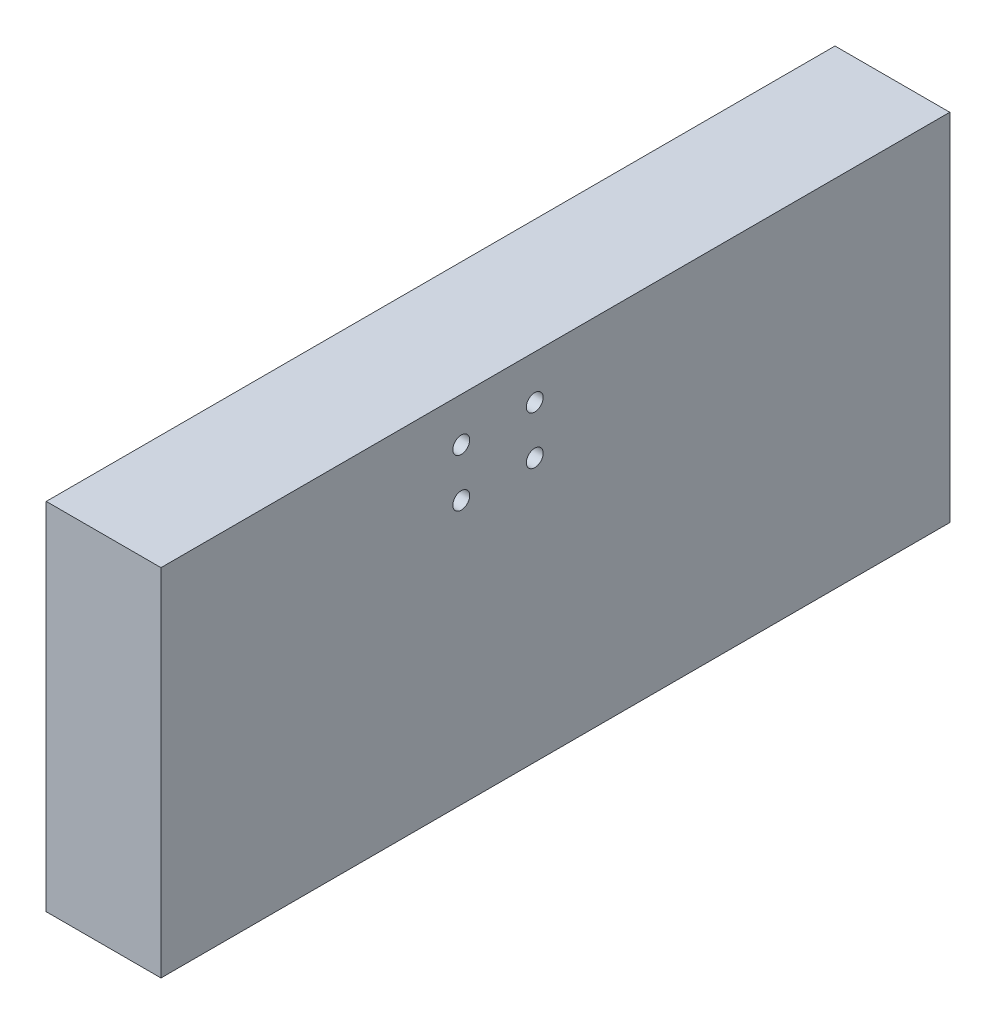
ISO-10303-21;
HEADER;
FILE_DESCRIPTION(('STEP AP214'),'2;1');
FILE_NAME('part.step','',(''),(''),'','','');
FILE_SCHEMA(('AUTOMOTIVE_DESIGN { 1 0 10303 214 1 1 1 1 }'));
ENDSEC;
DATA;
#1=APPLICATION_CONTEXT('core data for automotive mechanical design processes');
#2=APPLICATION_PROTOCOL_DEFINITION('international standard','automotive_design',2000,#1);
#3=PRODUCT_CONTEXT('',#1,'mechanical');
#4=PRODUCT('Part','Part','',(#3));
#5=PRODUCT_RELATED_PRODUCT_CATEGORY('part','',(#4));
#6=PRODUCT_DEFINITION_FORMATION('','',#4);
#7=PRODUCT_DEFINITION_CONTEXT('part definition',#1,'design');
#8=PRODUCT_DEFINITION('design','',#6,#7);
#9=PRODUCT_DEFINITION_SHAPE('','',#8);
#10=(LENGTH_UNIT() NAMED_UNIT(*) SI_UNIT(.MILLI.,.METRE.));
#11=(NAMED_UNIT(*) PLANE_ANGLE_UNIT() SI_UNIT($,.RADIAN.));
#12=(NAMED_UNIT(*) SI_UNIT($,.STERADIAN.) SOLID_ANGLE_UNIT());
#13=UNCERTAINTY_MEASURE_WITH_UNIT(LENGTH_MEASURE(1.E-05),#10,'distance_accuracy_value','');
#14=(GEOMETRIC_REPRESENTATION_CONTEXT(3) GLOBAL_UNCERTAINTY_ASSIGNED_CONTEXT((#13)) GLOBAL_UNIT_ASSIGNED_CONTEXT((#10,
#11,#12)) REPRESENTATION_CONTEXT('',''));
#15=CARTESIAN_POINT('',(0.,0.,0.));
#16=DIRECTION('',(0.,0.,1.));
#17=DIRECTION('',(1.,0.,0.));
#18=AXIS2_PLACEMENT_3D('',#15,#16,#17);
#19=CARTESIAN_POINT('',(-75.,-59.,-75.));
#20=DIRECTION('',(0.,0.,-1.));
#21=DIRECTION('',(-1.,0.,0.));
#22=AXIS2_PLACEMENT_3D('',#19,#20,#21);
#23=PLANE('',#22);
#24=DIRECTION('',(0.,1.,0.));
#25=VECTOR('',#24,1.);
#26=CARTESIAN_POINT('',(-55.95,-59.,-75.));
#27=LINE('',#26,#25);
#28=CARTESIAN_POINT('',(-55.95,-59.,-75.));
#29=VERTEX_POINT('',#28);
#30=CARTESIAN_POINT('',(-55.95,0.,-75.));
#31=VERTEX_POINT('',#30);
#32=EDGE_CURVE('E160',#29,#31,#27,.T.);
#33=ORIENTED_EDGE('',*,*,#32,.F.);
#34=DIRECTION('',(-1.,0.,0.));
#35=VECTOR('',#34,1.);
#36=CARTESIAN_POINT('',(-75.,-59.,-75.));
#37=LINE('',#36,#35);
#38=CARTESIAN_POINT('',(-75.,-59.,-75.));
#39=VERTEX_POINT('',#38);
#40=EDGE_CURVE('E59',#29,#39,#37,.T.);
#41=ORIENTED_EDGE('',*,*,#40,.T.);
#42=DIRECTION('',(0.,1.,0.));
#43=VECTOR('',#42,1.);
#44=CARTESIAN_POINT('',(-75.,-59.,-75.));
#45=LINE('',#44,#43);
#46=CARTESIAN_POINT('',(-75.,0.,-75.));
#47=VERTEX_POINT('',#46);
#48=EDGE_CURVE('E11',#39,#47,#45,.T.);
#49=ORIENTED_EDGE('',*,*,#48,.T.);
#50=DIRECTION('',(-1.,0.,0.));
#51=VECTOR('',#50,1.);
#52=CARTESIAN_POINT('',(-75.,0.,-75.));
#53=LINE('',#52,#51);
#54=EDGE_CURVE('E104',#31,#47,#53,.T.);
#55=ORIENTED_EDGE('',*,*,#54,.F.);
#56=EDGE_LOOP('',(#33,#41,#49,#55));
#57=FACE_BOUND('',#56,.T.);
#58=ADVANCED_FACE('F43',(#57),#23,.T.);
#59=CARTESIAN_POINT('',(-75.,-59.,75.));
#60=DIRECTION('',(-1.,0.,0.));
#61=DIRECTION('',(0.,0.,1.));
#62=AXIS2_PLACEMENT_3D('',#59,#60,#61);
#63=PLANE('',#62);
#64=DIRECTION('',(0.,1.,0.));
#65=VECTOR('',#64,1.);
#66=CARTESIAN_POINT('',(-75.,-59.,55.95));
#67=LINE('',#66,#65);
#68=CARTESIAN_POINT('',(-75.,-59.,55.95));
#69=VERTEX_POINT('',#68);
#70=CARTESIAN_POINT('',(-75.,0.,55.95));
#71=VERTEX_POINT('',#70);
#72=EDGE_CURVE('E88',#69,#71,#67,.T.);
#73=ORIENTED_EDGE('',*,*,#72,.T.);
#74=DIRECTION('',(0.,0.,1.));
#75=VECTOR('',#74,1.);
#76=CARTESIAN_POINT('',(-75.,0.,75.));
#77=LINE('',#76,#75);
#78=EDGE_CURVE('E117',#47,#71,#77,.T.);
#79=ORIENTED_EDGE('',*,*,#78,.F.);
#80=ORIENTED_EDGE('',*,*,#48,.F.);
#81=DIRECTION('',(0.,0.,1.));
#82=VECTOR('',#81,1.);
#83=CARTESIAN_POINT('',(-75.,-59.,75.));
#84=LINE('',#83,#82);
#85=EDGE_CURVE('E53',#39,#69,#84,.T.);
#86=ORIENTED_EDGE('',*,*,#85,.T.);
#87=EDGE_LOOP('',(#73,#79,#80,#86));
#88=FACE_BOUND('',#87,.T.);
#89=CARTESIAN_POINT('',(-75.,-7.24999999999999,6.1));
#90=DIRECTION('',(1.,0.,0.));
#91=DIRECTION('',(0.,0.,-1.));
#92=AXIS2_PLACEMENT_3D('',#89,#90,#91);
#93=CIRCLE('',#92,1.4);
#94=CARTESIAN_POINT('',(-75.,-7.24999999999999,4.7));
#95=VERTEX_POINT('',#94);
#96=EDGE_CURVE('E171',#95,#95,#93,.T.);
#97=ORIENTED_EDGE('',*,*,#96,.T.);
#98=EDGE_LOOP('',(#97));
#99=FACE_BOUND('',#98,.T.);
#100=CARTESIAN_POINT('',(-75.,-7.25,-6.1));
#101=DIRECTION('',(-1.,0.,0.));
#102=DIRECTION('',(0.,0.,1.));
#103=AXIS2_PLACEMENT_3D('',#100,#101,#102);
#104=CIRCLE('',#103,1.4);
#105=CARTESIAN_POINT('',(-75.,-7.25,-4.7));
#106=VERTEX_POINT('',#105);
#107=EDGE_CURVE('E112',#106,#106,#104,.T.);
#108=ORIENTED_EDGE('',*,*,#107,.F.);
#109=EDGE_LOOP('',(#108));
#110=FACE_BOUND('',#109,.T.);
#111=CARTESIAN_POINT('',(-75.,-15.25,6.1));
#112=DIRECTION('',(-1.,0.,0.));
#113=DIRECTION('',(0.,0.,1.));
#114=AXIS2_PLACEMENT_3D('',#111,#112,#113);
#115=CIRCLE('',#114,1.4);
#116=CARTESIAN_POINT('',(-75.,-15.25,7.5));
#117=VERTEX_POINT('',#116);
#118=EDGE_CURVE('E167',#117,#117,#115,.T.);
#119=ORIENTED_EDGE('',*,*,#118,.F.);
#120=EDGE_LOOP('',(#119));
#121=FACE_BOUND('',#120,.T.);
#122=CARTESIAN_POINT('',(-75.,-15.25,-6.1));
#123=DIRECTION('',(1.,0.,0.));
#124=DIRECTION('',(0.,0.,-1.));
#125=AXIS2_PLACEMENT_3D('',#122,#123,#124);
#126=CIRCLE('',#125,1.4);
#127=CARTESIAN_POINT('',(-75.,-15.25,-7.5));
#128=VERTEX_POINT('',#127);
#129=EDGE_CURVE('E162',#128,#128,#126,.T.);
#130=ORIENTED_EDGE('',*,*,#129,.T.);
#131=EDGE_LOOP('',(#130));
#132=FACE_BOUND('',#131,.T.);
#133=ADVANCED_FACE('F144',(#88,#99,#110,#121,#132),#63,.T.);
#134=CARTESIAN_POINT('',(-55.95,-59.,55.95));
#135=DIRECTION('',(-1.,0.,0.));
#136=DIRECTION('',(0.,0.,1.));
#137=AXIS2_PLACEMENT_3D('',#134,#135,#136);
#138=PLANE('',#137);
#139=CARTESIAN_POINT('',(-55.95,-15.25,6.1));
#140=DIRECTION('',(-1.,0.,0.));
#141=DIRECTION('',(0.,0.,1.));
#142=AXIS2_PLACEMENT_3D('',#139,#140,#141);
#143=CIRCLE('',#142,1.4);
#144=CARTESIAN_POINT('',(-55.95,-15.25,7.5));
#145=VERTEX_POINT('',#144);
#146=EDGE_CURVE('E132',#145,#145,#143,.T.);
#147=ORIENTED_EDGE('',*,*,#146,.T.);
#148=EDGE_LOOP('',(#147));
#149=FACE_BOUND('',#148,.T.);
#150=CARTESIAN_POINT('',(-55.95,-7.25,-6.1));
#151=DIRECTION('',(-1.,0.,0.));
#152=DIRECTION('',(0.,0.,1.));
#153=AXIS2_PLACEMENT_3D('',#150,#151,#152);
#154=CIRCLE('',#153,1.4);
#155=CARTESIAN_POINT('',(-55.95,-7.25,-4.7));
#156=VERTEX_POINT('',#155);
#157=EDGE_CURVE('E125',#156,#156,#154,.T.);
#158=ORIENTED_EDGE('',*,*,#157,.T.);
#159=EDGE_LOOP('',(#158));
#160=FACE_BOUND('',#159,.T.);
#161=DIRECTION('',(0.,0.,1.));
#162=VECTOR('',#161,1.);
#163=CARTESIAN_POINT('',(-55.95,0.,55.95));
#164=LINE('',#163,#162);
#165=CARTESIAN_POINT('',(-55.95,0.,55.95));
#166=VERTEX_POINT('',#165);
#167=EDGE_CURVE('E102',#31,#166,#164,.T.);
#168=ORIENTED_EDGE('',*,*,#167,.T.);
#169=DIRECTION('',(0.,1.,0.));
#170=VECTOR('',#169,1.);
#171=CARTESIAN_POINT('',(-55.95,-59.,55.95));
#172=LINE('',#171,#170);
#173=CARTESIAN_POINT('',(-55.95,-59.,55.95));
#174=VERTEX_POINT('',#173);
#175=EDGE_CURVE('E85',#174,#166,#172,.T.);
#176=ORIENTED_EDGE('',*,*,#175,.F.);
#177=DIRECTION('',(0.,0.,1.));
#178=VECTOR('',#177,1.);
#179=CARTESIAN_POINT('',(-55.95,-59.,55.95));
#180=LINE('',#179,#178);
#181=EDGE_CURVE('E101',#29,#174,#180,.T.);
#182=ORIENTED_EDGE('',*,*,#181,.F.);
#183=ORIENTED_EDGE('',*,*,#32,.T.);
#184=EDGE_LOOP('',(#168,#176,#182,#183));
#185=FACE_BOUND('',#184,.T.);
#186=CARTESIAN_POINT('',(-55.95,-7.24999999999999,6.1));
#187=DIRECTION('',(-1.,0.,0.));
#188=DIRECTION('',(0.,0.,1.));
#189=AXIS2_PLACEMENT_3D('',#186,#187,#188);
#190=CIRCLE('',#189,1.4);
#191=CARTESIAN_POINT('',(-55.95,-7.24999999999999,7.5));
#192=VERTEX_POINT('',#191);
#193=EDGE_CURVE('E129',#192,#192,#190,.F.);
#194=ORIENTED_EDGE('',*,*,#193,.F.);
#195=EDGE_LOOP('',(#194));
#196=FACE_BOUND('',#195,.T.);
#197=CARTESIAN_POINT('',(-55.95,-15.25,-6.1));
#198=DIRECTION('',(-1.,0.,0.));
#199=DIRECTION('',(0.,0.,1.));
#200=AXIS2_PLACEMENT_3D('',#197,#198,#199);
#201=CIRCLE('',#200,1.4);
#202=CARTESIAN_POINT('',(-55.95,-15.25,-4.7));
#203=VERTEX_POINT('',#202);
#204=EDGE_CURVE('E46',#203,#203,#201,.F.);
#205=ORIENTED_EDGE('',*,*,#204,.F.);
#206=EDGE_LOOP('',(#205));
#207=FACE_BOUND('',#206,.T.);
#208=ADVANCED_FACE('F98',(#149,#160,#185,#196,#207),#138,.F.);
#209=CARTESIAN_POINT('',(0.,-59.,0.));
#210=DIRECTION('',(0.,-1.,0.));
#211=DIRECTION('',(0.,0.,-1.));
#212=AXIS2_PLACEMENT_3D('',#209,#210,#211);
#213=PLANE('',#212);
#214=DIRECTION('',(-1.,0.,0.));
#215=VECTOR('',#214,1.);
#216=CARTESIAN_POINT('',(0.,-59.,55.95));
#217=LINE('',#216,#215);
#218=EDGE_CURVE('E82',#174,#69,#217,.T.);
#219=ORIENTED_EDGE('',*,*,#218,.T.);
#220=ORIENTED_EDGE('',*,*,#85,.F.);
#221=ORIENTED_EDGE('',*,*,#40,.F.);
#222=ORIENTED_EDGE('',*,*,#181,.T.);
#223=EDGE_LOOP('',(#219,#220,#221,#222));
#224=FACE_BOUND('',#223,.T.);
#225=ADVANCED_FACE('F106',(#224),#213,.T.);
#226=CARTESIAN_POINT('',(0.,0.,0.));
#227=DIRECTION('',(0.,-1.,0.));
#228=DIRECTION('',(0.,0.,-1.));
#229=AXIS2_PLACEMENT_3D('',#226,#227,#228);
#230=PLANE('',#229);
#231=ORIENTED_EDGE('',*,*,#78,.T.);
#232=DIRECTION('',(-1.,0.,0.));
#233=VECTOR('',#232,1.);
#234=CARTESIAN_POINT('',(0.,0.,55.95));
#235=LINE('',#234,#233);
#236=EDGE_CURVE('E94',#166,#71,#235,.T.);
#237=ORIENTED_EDGE('',*,*,#236,.F.);
#238=ORIENTED_EDGE('',*,*,#167,.F.);
#239=ORIENTED_EDGE('',*,*,#54,.T.);
#240=EDGE_LOOP('',(#231,#237,#238,#239));
#241=FACE_BOUND('',#240,.T.);
#242=ADVANCED_FACE('F150',(#241),#230,.F.);
#243=CARTESIAN_POINT('',(-55.,-7.25,-6.1));
#244=DIRECTION('',(-1.,0.,0.));
#245=DIRECTION('',(0.,0.,1.));
#246=AXIS2_PLACEMENT_3D('',#243,#244,#245);
#247=CYLINDRICAL_SURFACE('',#246,1.4);
#248=ORIENTED_EDGE('',*,*,#107,.T.);
#249=EDGE_LOOP('',(#248));
#250=FACE_BOUND('',#249,.T.);
#251=ORIENTED_EDGE('',*,*,#157,.F.);
#252=EDGE_LOOP('',(#251));
#253=FACE_BOUND('',#252,.T.);
#254=ADVANCED_FACE('F195',(#250,#253),#247,.F.);
#255=CARTESIAN_POINT('',(-55.,-7.24999999999999,6.1));
#256=DIRECTION('',(-1.,0.,0.));
#257=DIRECTION('',(0.,0.,1.));
#258=AXIS2_PLACEMENT_3D('',#255,#256,#257);
#259=CYLINDRICAL_SURFACE('',#258,1.4);
#260=ORIENTED_EDGE('',*,*,#96,.F.);
#261=EDGE_LOOP('',(#260));
#262=FACE_BOUND('',#261,.T.);
#263=ORIENTED_EDGE('',*,*,#193,.T.);
#264=EDGE_LOOP('',(#263));
#265=FACE_BOUND('',#264,.T.);
#266=ADVANCED_FACE('F192',(#262,#265),#259,.F.);
#267=CARTESIAN_POINT('',(-55.,-15.25,6.1));
#268=DIRECTION('',(-1.,0.,0.));
#269=DIRECTION('',(0.,0.,1.));
#270=AXIS2_PLACEMENT_3D('',#267,#268,#269);
#271=CYLINDRICAL_SURFACE('',#270,1.4);
#272=ORIENTED_EDGE('',*,*,#118,.T.);
#273=EDGE_LOOP('',(#272));
#274=FACE_BOUND('',#273,.T.);
#275=ORIENTED_EDGE('',*,*,#146,.F.);
#276=EDGE_LOOP('',(#275));
#277=FACE_BOUND('',#276,.T.);
#278=ADVANCED_FACE('F179',(#274,#277),#271,.F.);
#279=CARTESIAN_POINT('',(-55.,-15.25,-6.1));
#280=DIRECTION('',(-1.,0.,0.));
#281=DIRECTION('',(0.,0.,1.));
#282=AXIS2_PLACEMENT_3D('',#279,#280,#281);
#283=CYLINDRICAL_SURFACE('',#282,1.4);
#284=ORIENTED_EDGE('',*,*,#129,.F.);
#285=EDGE_LOOP('',(#284));
#286=FACE_BOUND('',#285,.T.);
#287=ORIENTED_EDGE('',*,*,#204,.T.);
#288=EDGE_LOOP('',(#287));
#289=FACE_BOUND('',#288,.T.);
#290=ADVANCED_FACE('F141',(#286,#289),#283,.F.);
#291=CARTESIAN_POINT('',(0.,-59.,55.95));
#292=DIRECTION('',(0.,0.,-1.));
#293=DIRECTION('',(-1.,0.,0.));
#294=AXIS2_PLACEMENT_3D('',#291,#292,#293);
#295=PLANE('',#294);
#296=ORIENTED_EDGE('',*,*,#236,.T.);
#297=ORIENTED_EDGE('',*,*,#72,.F.);
#298=ORIENTED_EDGE('',*,*,#218,.F.);
#299=ORIENTED_EDGE('',*,*,#175,.T.);
#300=EDGE_LOOP('',(#296,#297,#298,#299));
#301=FACE_BOUND('',#300,.T.);
#302=ADVANCED_FACE('F84',(#301),#295,.F.);
#303=CLOSED_SHELL('',(#58,#133,#208,#225,#242,#254,#266,#278,#290,#302));
#304=MANIFOLD_SOLID_BREP('B2',#303);
#305=ADVANCED_BREP_SHAPE_REPRESENTATION('',(#18,#304),#14);
#306=SHAPE_DEFINITION_REPRESENTATION(#9,#305);
ENDSEC;
END-ISO-10303-21;
